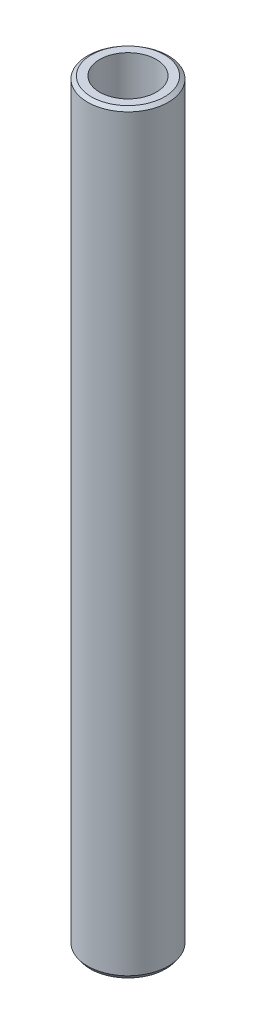
ISO-10303-21;
HEADER;
FILE_DESCRIPTION(('STEP AP214'),'2;1');
FILE_NAME('part.step','',(''),(''),'','','');
FILE_SCHEMA(('AUTOMOTIVE_DESIGN { 1 0 10303 214 1 1 1 1 }'));
ENDSEC;
DATA;
#1=APPLICATION_CONTEXT('core data for automotive mechanical design processes');
#2=APPLICATION_PROTOCOL_DEFINITION('international standard','automotive_design',2000,#1);
#3=PRODUCT_CONTEXT('',#1,'mechanical');
#4=PRODUCT('Part','Part','',(#3));
#5=PRODUCT_RELATED_PRODUCT_CATEGORY('part','',(#4));
#6=PRODUCT_DEFINITION_FORMATION('','',#4);
#7=PRODUCT_DEFINITION_CONTEXT('part definition',#1,'design');
#8=PRODUCT_DEFINITION('design','',#6,#7);
#9=PRODUCT_DEFINITION_SHAPE('','',#8);
#10=(LENGTH_UNIT() NAMED_UNIT(*) SI_UNIT(.MILLI.,.METRE.));
#11=(NAMED_UNIT(*) PLANE_ANGLE_UNIT() SI_UNIT($,.RADIAN.));
#12=(NAMED_UNIT(*) SI_UNIT($,.STERADIAN.) SOLID_ANGLE_UNIT());
#13=UNCERTAINTY_MEASURE_WITH_UNIT(LENGTH_MEASURE(1.E-05),#10,'distance_accuracy_value','');
#14=(GEOMETRIC_REPRESENTATION_CONTEXT(3) GLOBAL_UNCERTAINTY_ASSIGNED_CONTEXT((#13)) GLOBAL_UNIT_ASSIGNED_CONTEXT((#10,
#11,#12)) REPRESENTATION_CONTEXT('',''));
#15=CARTESIAN_POINT('',(0.,0.,0.));
#16=DIRECTION('',(0.,0.,1.));
#17=DIRECTION('',(1.,0.,0.));
#18=AXIS2_PLACEMENT_3D('',#15,#16,#17);
#19=CARTESIAN_POINT('',(0.,233.830443088042,0.));
#20=DIRECTION('',(0.,-1.,0.));
#21=DIRECTION('',(0.,0.,-1.));
#22=AXIS2_PLACEMENT_3D('',#19,#20,#21);
#23=CYLINDRICAL_SURFACE('',#22,12.5);
#24=CARTESIAN_POINT('',(0.,232.987096896159,0.));
#25=DIRECTION('',(0.,1.,0.));
#26=DIRECTION('',(0.,0.,1.));
#27=AXIS2_PLACEMENT_3D('',#24,#25,#26);
#28=CIRCLE('',#27,12.5);
#29=CARTESIAN_POINT('',(0.,232.987096896159,12.5));
#30=VERTEX_POINT('',#29);
#31=EDGE_CURVE('E50',#30,#30,#28,.F.);
#32=ORIENTED_EDGE('',*,*,#31,.T.);
#33=EDGE_LOOP('',(#32));
#34=FACE_BOUND('',#33,.T.);
#35=CARTESIAN_POINT('',(0.,1.18733460367612,0.));
#36=DIRECTION('',(0.,1.,0.));
#37=DIRECTION('',(0.,0.,1.));
#38=AXIS2_PLACEMENT_3D('',#35,#36,#37);
#39=CIRCLE('',#38,12.5);
#40=CARTESIAN_POINT('',(0.,1.18733460367612,12.5));
#41=VERTEX_POINT('',#40);
#42=EDGE_CURVE('E51',#41,#41,#39,.T.);
#43=ORIENTED_EDGE('',*,*,#42,.T.);
#44=EDGE_LOOP('',(#43));
#45=FACE_BOUND('',#44,.T.);
#46=ADVANCED_FACE('F39',(#34,#45),#23,.T.);
#47=CARTESIAN_POINT('',(0.,233.830443088042,0.));
#48=DIRECTION('',(0.,1.,0.));
#49=DIRECTION('',(0.,0.,1.));
#50=AXIS2_PLACEMENT_3D('',#47,#48,#49);
#51=PLANE('',#50);
#52=CARTESIAN_POINT('',(0.,233.830443088042,0.));
#53=DIRECTION('',(0.,1.,0.));
#54=DIRECTION('',(0.,0.,1.));
#55=AXIS2_PLACEMENT_3D('',#52,#53,#54);
#56=CIRCLE('',#55,11.3126653963239);
#57=CARTESIAN_POINT('',(0.,233.830443088042,11.3126653963239));
#58=VERTEX_POINT('',#57);
#59=EDGE_CURVE('E54',#58,#58,#56,.T.);
#60=ORIENTED_EDGE('',*,*,#59,.T.);
#61=EDGE_LOOP('',(#60));
#62=FACE_BOUND('',#61,.T.);
#63=CARTESIAN_POINT('',(0.,233.830443088042,0.));
#64=DIRECTION('',(0.,1.,0.));
#65=DIRECTION('',(0.,0.,1.));
#66=AXIS2_PLACEMENT_3D('',#63,#64,#65);
#67=CIRCLE('',#66,8.78718463649901);
#68=CARTESIAN_POINT('',(0.,233.830443088042,8.78718463649901));
#69=VERTEX_POINT('',#68);
#70=EDGE_CURVE('E58',#69,#69,#67,.T.);
#71=ORIENTED_EDGE('',*,*,#70,.F.);
#72=EDGE_LOOP('',(#71));
#73=FACE_BOUND('',#72,.T.);
#74=ADVANCED_FACE('F69',(#62,#73),#51,.T.);
#75=CARTESIAN_POINT('',(0.,0.,0.));
#76=DIRECTION('',(0.,1.,0.));
#77=DIRECTION('',(0.,0.,1.));
#78=AXIS2_PLACEMENT_3D('',#75,#76,#77);
#79=PLANE('',#78);
#80=CARTESIAN_POINT('',(0.,0.,0.));
#81=DIRECTION('',(0.,1.,0.));
#82=DIRECTION('',(0.,0.,1.));
#83=AXIS2_PLACEMENT_3D('',#80,#81,#82);
#84=CIRCLE('',#83,11.6566538081172);
#85=CARTESIAN_POINT('',(0.,0.,11.6566538081172));
#86=VERTEX_POINT('',#85);
#87=EDGE_CURVE('E10',#86,#86,#84,.F.);
#88=ORIENTED_EDGE('',*,*,#87,.T.);
#89=EDGE_LOOP('',(#88));
#90=FACE_BOUND('',#89,.T.);
#91=CARTESIAN_POINT('',(0.,0.,0.));
#92=DIRECTION('',(0.,1.,0.));
#93=DIRECTION('',(0.,0.,1.));
#94=AXIS2_PLACEMENT_3D('',#91,#92,#93);
#95=CIRCLE('',#94,8.78718463649901);
#96=CARTESIAN_POINT('',(0.,0.,8.78718463649901));
#97=VERTEX_POINT('',#96);
#98=EDGE_CURVE('E63',#97,#97,#95,.T.);
#99=ORIENTED_EDGE('',*,*,#98,.T.);
#100=EDGE_LOOP('',(#99));
#101=FACE_BOUND('',#100,.T.);
#102=ADVANCED_FACE('F75',(#90,#101),#79,.F.);
#103=CARTESIAN_POINT('',(0.,233.830443088042,0.));
#104=DIRECTION('',(0.,-1.,0.));
#105=DIRECTION('',(0.,0.,-1.));
#106=AXIS2_PLACEMENT_3D('',#103,#104,#105);
#107=CYLINDRICAL_SURFACE('',#106,8.78718463649901);
#108=ORIENTED_EDGE('',*,*,#70,.T.);
#109=EDGE_LOOP('',(#108));
#110=FACE_BOUND('',#109,.T.);
#111=ORIENTED_EDGE('',*,*,#98,.F.);
#112=EDGE_LOOP('',(#111));
#113=FACE_BOUND('',#112,.T.);
#114=ADVANCED_FACE('F70',(#110,#113),#107,.F.);
#115=CARTESIAN_POINT('',(0.,233.830443088042,0.));
#116=DIRECTION('',(0.,-1.,0.));
#117=DIRECTION('',(0.,0.,-1.));
#118=AXIS2_PLACEMENT_3D('',#115,#116,#117);
#119=CONICAL_SURFACE('',#118,11.3126653963239,0.953200848067756);
#120=ORIENTED_EDGE('',*,*,#31,.F.);
#121=EDGE_LOOP('',(#120));
#122=FACE_BOUND('',#121,.T.);
#123=ORIENTED_EDGE('',*,*,#59,.F.);
#124=EDGE_LOOP('',(#123));
#125=FACE_BOUND('',#124,.T.);
#126=ADVANCED_FACE('F81',(#122,#125),#119,.T.);
#127=CARTESIAN_POINT('',(0.,1.18733460367612,0.));
#128=DIRECTION('',(0.,1.,0.));
#129=DIRECTION('',(0.,0.,1.));
#130=AXIS2_PLACEMENT_3D('',#127,#128,#129);
#131=CONICAL_SURFACE('',#130,12.5,0.617595478727126);
#132=ORIENTED_EDGE('',*,*,#87,.F.);
#133=EDGE_LOOP('',(#132));
#134=FACE_BOUND('',#133,.T.);
#135=ORIENTED_EDGE('',*,*,#42,.F.);
#136=EDGE_LOOP('',(#135));
#137=FACE_BOUND('',#136,.T.);
#138=ADVANCED_FACE('F45',(#134,#137),#131,.T.);
#139=CLOSED_SHELL('',(#46,#74,#102,#114,#126,#138));
#140=MANIFOLD_SOLID_BREP('B2',#139);
#141=ADVANCED_BREP_SHAPE_REPRESENTATION('',(#18,#140),#14);
#142=SHAPE_DEFINITION_REPRESENTATION(#9,#141);
ENDSEC;
END-ISO-10303-21;
